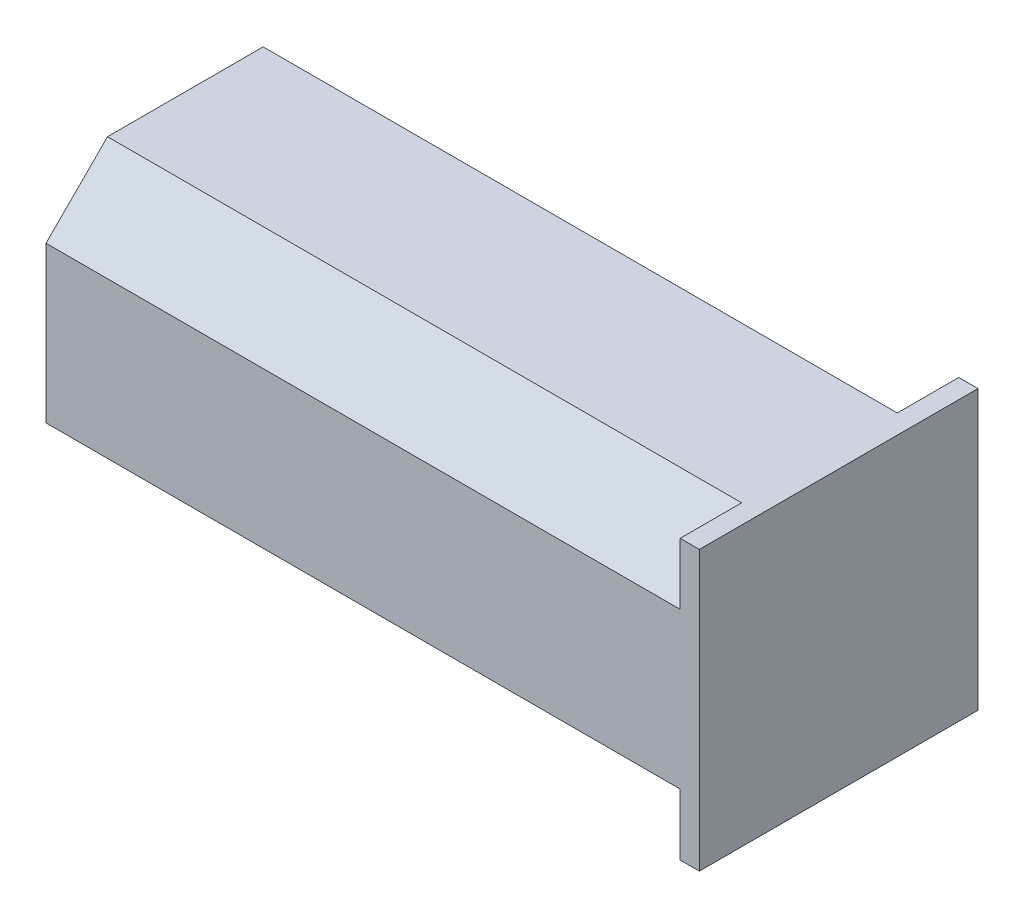
ISO-10303-21;
HEADER;
FILE_DESCRIPTION(('STEP AP214'),'2;1');
FILE_NAME('part.step','',(''),(''),'','','');
FILE_SCHEMA(('AUTOMOTIVE_DESIGN { 1 0 10303 214 1 1 1 1 }'));
ENDSEC;
DATA;
#1=APPLICATION_CONTEXT('core data for automotive mechanical design processes');
#2=APPLICATION_PROTOCOL_DEFINITION('international standard','automotive_design',2000,#1);
#3=PRODUCT_CONTEXT('',#1,'mechanical');
#4=PRODUCT('Part','Part','',(#3));
#5=PRODUCT_RELATED_PRODUCT_CATEGORY('part','',(#4));
#6=PRODUCT_DEFINITION_FORMATION('','',#4);
#7=PRODUCT_DEFINITION_CONTEXT('part definition',#1,'design');
#8=PRODUCT_DEFINITION('design','',#6,#7);
#9=PRODUCT_DEFINITION_SHAPE('','',#8);
#10=(LENGTH_UNIT() NAMED_UNIT(*) SI_UNIT(.MILLI.,.METRE.));
#11=(NAMED_UNIT(*) PLANE_ANGLE_UNIT() SI_UNIT($,.RADIAN.));
#12=(NAMED_UNIT(*) SI_UNIT($,.STERADIAN.) SOLID_ANGLE_UNIT());
#13=UNCERTAINTY_MEASURE_WITH_UNIT(LENGTH_MEASURE(1.E-05),#10,'distance_accuracy_value','');
#14=(GEOMETRIC_REPRESENTATION_CONTEXT(3) GLOBAL_UNCERTAINTY_ASSIGNED_CONTEXT((#13)) GLOBAL_UNIT_ASSIGNED_CONTEXT((#10,
#11,#12)) REPRESENTATION_CONTEXT('',''));
#15=CARTESIAN_POINT('',(0.,0.,0.));
#16=DIRECTION('',(0.,0.,1.));
#17=DIRECTION('',(1.,0.,0.));
#18=AXIS2_PLACEMENT_3D('',#15,#16,#17);
#19=CARTESIAN_POINT('',(122.000000000003,1.06322866211239E-13,1263.79860364586));
#20=DIRECTION('',(0.,0.,1.));
#21=DIRECTION('',(1.,0.,0.));
#22=AXIS2_PLACEMENT_3D('',#19,#20,#21);
#23=PLANE('',#22);
#24=DIRECTION('',(1.,0.,0.));
#25=VECTOR('',#24,1.);
#26=CARTESIAN_POINT('',(130.000000000003,-36.25,1263.79860364586));
#27=LINE('',#26,#25);
#28=CARTESIAN_POINT('',(122.000000000003,-36.25,1263.79860364586));
#29=VERTEX_POINT('',#28);
#30=CARTESIAN_POINT('',(127.000000000003,-36.25,1263.79860364586));
#31=VERTEX_POINT('',#30);
#32=EDGE_CURVE('E111',#29,#31,#27,.T.);
#33=ORIENTED_EDGE('',*,*,#32,.T.);
#34=DIRECTION('',(0.,1.,0.));
#35=VECTOR('',#34,1.);
#36=CARTESIAN_POINT('',(127.000000000003,1.06322866211239E-13,1263.79860364586));
#37=LINE('',#36,#35);
#38=CARTESIAN_POINT('',(127.000000000003,36.25,1263.79860364586));
#39=VERTEX_POINT('',#38);
#40=EDGE_CURVE('E102',#31,#39,#37,.T.);
#41=ORIENTED_EDGE('',*,*,#40,.T.);
#42=DIRECTION('',(1.,0.,0.));
#43=VECTOR('',#42,1.);
#44=CARTESIAN_POINT('',(130.000000000003,36.25,1263.79860364586));
#45=LINE('',#44,#43);
#46=CARTESIAN_POINT('',(122.000000000003,36.25,1263.79860364586));
#47=VERTEX_POINT('',#46);
#48=EDGE_CURVE('E20',#47,#39,#45,.T.);
#49=ORIENTED_EDGE('',*,*,#48,.F.);
#50=DIRECTION('',(0.,-1.,0.));
#51=VECTOR('',#50,1.);
#52=CARTESIAN_POINT('',(122.000000000003,36.25,1263.79860364586));
#53=LINE('',#52,#51);
#54=CARTESIAN_POINT('',(122.000000000003,20.25,1263.79860364586));
#55=VERTEX_POINT('',#54);
#56=EDGE_CURVE('E110',#47,#55,#53,.T.);
#57=ORIENTED_EDGE('',*,*,#56,.T.);
#58=DIRECTION('',(-1.,0.,0.));
#59=VECTOR('',#58,1.);
#60=CARTESIAN_POINT('',(122.000000000003,20.25,1263.79860364586));
#61=LINE('',#60,#59);
#62=CARTESIAN_POINT('',(-42.999999999997,20.25,1263.79860364586));
#63=VERTEX_POINT('',#62);
#64=EDGE_CURVE('E171',#55,#63,#61,.T.);
#65=ORIENTED_EDGE('',*,*,#64,.T.);
#66=DIRECTION('',(0.,-1.,0.));
#67=VECTOR('',#66,1.);
#68=CARTESIAN_POINT('',(-42.999999999997,1.26528871049308E-13,1263.79860364586));
#69=LINE('',#68,#67);
#70=CARTESIAN_POINT('',(-42.999999999997,-20.25,1263.79860364586));
#71=VERTEX_POINT('',#70);
#72=EDGE_CURVE('E168',#63,#71,#69,.T.);
#73=ORIENTED_EDGE('',*,*,#72,.T.);
#74=DIRECTION('',(1.,0.,0.));
#75=VECTOR('',#74,1.);
#76=CARTESIAN_POINT('',(122.000000000003,-20.25,1263.79860364586));
#77=LINE('',#76,#75);
#78=CARTESIAN_POINT('',(122.000000000003,-20.25,1263.79860364586));
#79=VERTEX_POINT('',#78);
#80=EDGE_CURVE('E170',#71,#79,#77,.T.);
#81=ORIENTED_EDGE('',*,*,#80,.T.);
#82=EDGE_CURVE('E115',#79,#29,#53,.T.);
#83=ORIENTED_EDGE('',*,*,#82,.T.);
#84=EDGE_LOOP('',(#33,#41,#49,#57,#65,#73,#81,#83));
#85=FACE_BOUND('',#84,.T.);
#86=ADVANCED_FACE('F16',(#85),#23,.T.);
#87=CARTESIAN_POINT('',(122.000000000003,-36.25,1227.54860364586));
#88=DIRECTION('',(0.,-1.,0.));
#89=DIRECTION('',(-1.,0.,0.));
#90=AXIS2_PLACEMENT_3D('',#87,#88,#89);
#91=PLANE('',#90);
#92=DIRECTION('',(1.,0.,0.));
#93=VECTOR('',#92,1.);
#94=CARTESIAN_POINT('',(130.000000000003,-36.25,1191.29860364586));
#95=LINE('',#94,#93);
#96=CARTESIAN_POINT('',(122.000000000003,-36.25,1191.29860364586));
#97=VERTEX_POINT('',#96);
#98=CARTESIAN_POINT('',(127.000000000003,-36.25,1191.29860364586));
#99=VERTEX_POINT('',#98);
#100=EDGE_CURVE('E122',#97,#99,#95,.T.);
#101=ORIENTED_EDGE('',*,*,#100,.T.);
#102=DIRECTION('',(0.,0.,1.));
#103=VECTOR('',#102,1.);
#104=CARTESIAN_POINT('',(127.000000000003,-36.25,1227.54860364586));
#105=LINE('',#104,#103);
#106=EDGE_CURVE('E105',#99,#31,#105,.T.);
#107=ORIENTED_EDGE('',*,*,#106,.T.);
#108=ORIENTED_EDGE('',*,*,#32,.F.);
#109=DIRECTION('',(0.,0.,1.));
#110=VECTOR('',#109,1.);
#111=CARTESIAN_POINT('',(122.000000000003,-36.25,1191.29860364586));
#112=LINE('',#111,#110);
#113=CARTESIAN_POINT('',(122.000000000003,-36.25,1247.79860364586));
#114=VERTEX_POINT('',#113);
#115=EDGE_CURVE('E198',#114,#29,#112,.T.);
#116=ORIENTED_EDGE('',*,*,#115,.F.);
#117=DIRECTION('',(-1.,0.,0.));
#118=VECTOR('',#117,1.);
#119=CARTESIAN_POINT('',(122.000000000003,-36.25,1247.79860364586));
#120=LINE('',#119,#118);
#121=CARTESIAN_POINT('',(-42.999999999997,-36.25,1247.79860364586));
#122=VERTEX_POINT('',#121);
#123=EDGE_CURVE('E123',#114,#122,#120,.T.);
#124=ORIENTED_EDGE('',*,*,#123,.T.);
#125=DIRECTION('',(0.,0.,-1.));
#126=VECTOR('',#125,1.);
#127=CARTESIAN_POINT('',(-42.999999999997,-36.25,1227.54860364586));
#128=LINE('',#127,#126);
#129=CARTESIAN_POINT('',(-42.999999999997,-36.25,1207.29860364586));
#130=VERTEX_POINT('',#129);
#131=EDGE_CURVE('E126',#122,#130,#128,.T.);
#132=ORIENTED_EDGE('',*,*,#131,.T.);
#133=DIRECTION('',(1.,0.,0.));
#134=VECTOR('',#133,1.);
#135=CARTESIAN_POINT('',(122.000000000003,-36.25,1207.29860364586));
#136=LINE('',#135,#134);
#137=CARTESIAN_POINT('',(122.000000000003,-36.25,1207.29860364586));
#138=VERTEX_POINT('',#137);
#139=EDGE_CURVE('E134',#130,#138,#136,.T.);
#140=ORIENTED_EDGE('',*,*,#139,.T.);
#141=EDGE_CURVE('E150',#97,#138,#112,.T.);
#142=ORIENTED_EDGE('',*,*,#141,.F.);
#143=EDGE_LOOP('',(#101,#107,#108,#116,#124,#132,#140,#142));
#144=FACE_BOUND('',#143,.T.);
#145=ADVANCED_FACE('F119',(#144),#91,.T.);
#146=CARTESIAN_POINT('',(122.000000000003,1.10762064243845E-13,1191.29860364586));
#147=DIRECTION('',(0.,0.,-1.));
#148=DIRECTION('',(-1.,0.,0.));
#149=AXIS2_PLACEMENT_3D('',#146,#147,#148);
#150=PLANE('',#149);
#151=DIRECTION('',(1.,0.,0.));
#152=VECTOR('',#151,1.);
#153=CARTESIAN_POINT('',(130.000000000003,36.25,1191.29860364586));
#154=LINE('',#153,#152);
#155=CARTESIAN_POINT('',(122.000000000003,36.25,1191.29860364586));
#156=VERTEX_POINT('',#155);
#157=CARTESIAN_POINT('',(127.000000000003,36.25,1191.29860364586));
#158=VERTEX_POINT('',#157);
#159=EDGE_CURVE('E133',#156,#158,#154,.T.);
#160=ORIENTED_EDGE('',*,*,#159,.T.);
#161=DIRECTION('',(0.,-1.,0.));
#162=VECTOR('',#161,1.);
#163=CARTESIAN_POINT('',(127.000000000003,1.10762064243845E-13,1191.29860364586));
#164=LINE('',#163,#162);
#165=EDGE_CURVE('E39',#158,#99,#164,.T.);
#166=ORIENTED_EDGE('',*,*,#165,.T.);
#167=ORIENTED_EDGE('',*,*,#100,.F.);
#168=DIRECTION('',(0.,-1.,0.));
#169=VECTOR('',#168,1.);
#170=CARTESIAN_POINT('',(122.000000000003,36.25,1191.29860364586));
#171=LINE('',#170,#169);
#172=CARTESIAN_POINT('',(122.000000000003,-20.25,1191.29860364586));
#173=VERTEX_POINT('',#172);
#174=EDGE_CURVE('E11',#173,#97,#171,.T.);
#175=ORIENTED_EDGE('',*,*,#174,.F.);
#176=DIRECTION('',(-1.,0.,0.));
#177=VECTOR('',#176,1.);
#178=CARTESIAN_POINT('',(122.000000000003,-20.25,1191.29860364586));
#179=LINE('',#178,#177);
#180=CARTESIAN_POINT('',(-42.999999999997,-20.25,1191.29860364586));
#181=VERTEX_POINT('',#180);
#182=EDGE_CURVE('E132',#173,#181,#179,.T.);
#183=ORIENTED_EDGE('',*,*,#182,.T.);
#184=DIRECTION('',(0.,1.,0.));
#185=VECTOR('',#184,1.);
#186=CARTESIAN_POINT('',(-42.999999999997,1.30968069081914E-13,1191.29860364586));
#187=LINE('',#186,#185);
#188=CARTESIAN_POINT('',(-42.999999999997,20.25,1191.29860364586));
#189=VERTEX_POINT('',#188);
#190=EDGE_CURVE('E173',#181,#189,#187,.T.);
#191=ORIENTED_EDGE('',*,*,#190,.T.);
#192=DIRECTION('',(1.,0.,0.));
#193=VECTOR('',#192,1.);
#194=CARTESIAN_POINT('',(122.000000000003,20.25,1191.29860364586));
#195=LINE('',#194,#193);
#196=CARTESIAN_POINT('',(122.000000000003,20.25,1191.29860364586));
#197=VERTEX_POINT('',#196);
#198=EDGE_CURVE('E176',#189,#197,#195,.T.);
#199=ORIENTED_EDGE('',*,*,#198,.T.);
#200=EDGE_CURVE('E164',#156,#197,#171,.T.);
#201=ORIENTED_EDGE('',*,*,#200,.F.);
#202=EDGE_LOOP('',(#160,#166,#167,#175,#183,#191,#199,#201));
#203=FACE_BOUND('',#202,.T.);
#204=ADVANCED_FACE('F250',(#203),#150,.T.);
#205=CARTESIAN_POINT('',(122.000000000003,36.25,1227.54860364586));
#206=DIRECTION('',(0.,1.,0.));
#207=DIRECTION('',(1.,0.,0.));
#208=AXIS2_PLACEMENT_3D('',#205,#206,#207);
#209=PLANE('',#208);
#210=ORIENTED_EDGE('',*,*,#48,.T.);
#211=DIRECTION('',(0.,0.,-1.));
#212=VECTOR('',#211,1.);
#213=CARTESIAN_POINT('',(127.000000000003,36.25,1227.54860364586));
#214=LINE('',#213,#212);
#215=EDGE_CURVE('E33',#39,#158,#214,.T.);
#216=ORIENTED_EDGE('',*,*,#215,.T.);
#217=ORIENTED_EDGE('',*,*,#159,.F.);
#218=DIRECTION('',(0.,0.,1.));
#219=VECTOR('',#218,1.);
#220=CARTESIAN_POINT('',(122.000000000003,36.25,1191.29860364586));
#221=LINE('',#220,#219);
#222=CARTESIAN_POINT('',(122.000000000003,36.25,1207.29860364586));
#223=VERTEX_POINT('',#222);
#224=EDGE_CURVE('E184',#156,#223,#221,.T.);
#225=ORIENTED_EDGE('',*,*,#224,.T.);
#226=DIRECTION('',(-1.,0.,0.));
#227=VECTOR('',#226,1.);
#228=CARTESIAN_POINT('',(122.000000000003,36.25,1207.29860364586));
#229=LINE('',#228,#227);
#230=CARTESIAN_POINT('',(-42.999999999997,36.25,1207.29860364586));
#231=VERTEX_POINT('',#230);
#232=EDGE_CURVE('E181',#223,#231,#229,.T.);
#233=ORIENTED_EDGE('',*,*,#232,.T.);
#234=DIRECTION('',(0.,0.,1.));
#235=VECTOR('',#234,1.);
#236=CARTESIAN_POINT('',(-42.999999999997,36.25,1227.54860364586));
#237=LINE('',#236,#235);
#238=CARTESIAN_POINT('',(-42.999999999997,36.25,1247.79860364586));
#239=VERTEX_POINT('',#238);
#240=EDGE_CURVE('E177',#231,#239,#237,.T.);
#241=ORIENTED_EDGE('',*,*,#240,.T.);
#242=DIRECTION('',(1.,0.,0.));
#243=VECTOR('',#242,1.);
#244=CARTESIAN_POINT('',(122.000000000003,36.25,1247.79860364586));
#245=LINE('',#244,#243);
#246=CARTESIAN_POINT('',(122.000000000003,36.25,1247.79860364586));
#247=VERTEX_POINT('',#246);
#248=EDGE_CURVE('E180',#239,#247,#245,.T.);
#249=ORIENTED_EDGE('',*,*,#248,.T.);
#250=EDGE_CURVE('E161',#247,#47,#221,.T.);
#251=ORIENTED_EDGE('',*,*,#250,.T.);
#252=EDGE_LOOP('',(#210,#216,#217,#225,#233,#241,#249,#251));
#253=FACE_BOUND('',#252,.T.);
#254=ADVANCED_FACE('F273',(#253),#209,.T.);
#255=CARTESIAN_POINT('',(-42.999999999997,1.28748470065611E-13,1227.54860364586));
#256=DIRECTION('',(-1.,0.,0.));
#257=DIRECTION('',(0.,1.,0.));
#258=AXIS2_PLACEMENT_3D('',#255,#256,#257);
#259=PLANE('',#258);
#260=ORIENTED_EDGE('',*,*,#240,.F.);
#261=DIRECTION('',(0.,0.707106781186547,0.707106781186548));
#262=VECTOR('',#261,1.);
#263=CARTESIAN_POINT('',(-42.999999999997,28.25,1199.29860364586));
#264=LINE('',#263,#262);
#265=EDGE_CURVE('E158',#231,#189,#264,.F.);
#266=ORIENTED_EDGE('',*,*,#265,.T.);
#267=ORIENTED_EDGE('',*,*,#190,.F.);
#268=DIRECTION('',(0.,0.707106781186547,-0.707106781186548));
#269=VECTOR('',#268,1.);
#270=CARTESIAN_POINT('',(-42.999999999997,-28.25,1199.29860364586));
#271=LINE('',#270,#269);
#272=EDGE_CURVE('E160',#181,#130,#271,.F.);
#273=ORIENTED_EDGE('',*,*,#272,.T.);
#274=ORIENTED_EDGE('',*,*,#131,.F.);
#275=DIRECTION('',(0.,-0.707106781186547,-0.707106781186548));
#276=VECTOR('',#275,1.);
#277=CARTESIAN_POINT('',(-42.999999999997,-28.25,1255.79860364586));
#278=LINE('',#277,#276);
#279=EDGE_CURVE('E165',#122,#71,#278,.F.);
#280=ORIENTED_EDGE('',*,*,#279,.T.);
#281=ORIENTED_EDGE('',*,*,#72,.F.);
#282=DIRECTION('',(0.,-0.707106781186547,0.707106781186548));
#283=VECTOR('',#282,1.);
#284=CARTESIAN_POINT('',(-42.999999999997,28.25,1255.79860364586));
#285=LINE('',#284,#283);
#286=EDGE_CURVE('E162',#63,#239,#285,.F.);
#287=ORIENTED_EDGE('',*,*,#286,.T.);
#288=EDGE_LOOP('',(#260,#266,#267,#273,#274,#280,#281,#287));
#289=FACE_BOUND('',#288,.T.);
#290=ADVANCED_FACE('F243',(#289),#259,.T.);
#291=CARTESIAN_POINT('',(122.000000000003,36.25,1207.29860364586));
#292=DIRECTION('',(0.,-0.707106781186548,0.707106781186547));
#293=DIRECTION('',(0.,-0.707106781186547,-0.707106781186548));
#294=AXIS2_PLACEMENT_3D('',#291,#292,#293);
#295=PLANE('',#294);
#296=DIRECTION('',(0.,-0.707106781186547,-0.707106781186548));
#297=VECTOR('',#296,1.);
#298=CARTESIAN_POINT('',(122.000000000003,28.25,1199.29860364586));
#299=LINE('',#298,#297);
#300=EDGE_CURVE('E216',#197,#223,#299,.F.);
#301=ORIENTED_EDGE('',*,*,#300,.F.);
#302=ORIENTED_EDGE('',*,*,#198,.F.);
#303=ORIENTED_EDGE('',*,*,#265,.F.);
#304=ORIENTED_EDGE('',*,*,#232,.F.);
#305=EDGE_LOOP('',(#301,#302,#303,#304));
#306=FACE_BOUND('',#305,.T.);
#307=ADVANCED_FACE('F278',(#306),#295,.F.);
#308=CARTESIAN_POINT('',(122.000000000003,20.25,1263.79860364586));
#309=DIRECTION('',(0.,-0.707106781186548,-0.707106781186547));
#310=DIRECTION('',(0.,0.707106781186547,-0.707106781186548));
#311=AXIS2_PLACEMENT_3D('',#308,#309,#310);
#312=PLANE('',#311);
#313=DIRECTION('',(0.,0.707106781186547,-0.707106781186548));
#314=VECTOR('',#313,1.);
#315=CARTESIAN_POINT('',(122.000000000003,28.25,1255.79860364586));
#316=LINE('',#315,#314);
#317=EDGE_CURVE('E220',#247,#55,#316,.F.);
#318=ORIENTED_EDGE('',*,*,#317,.F.);
#319=ORIENTED_EDGE('',*,*,#248,.F.);
#320=ORIENTED_EDGE('',*,*,#286,.F.);
#321=ORIENTED_EDGE('',*,*,#64,.F.);
#322=EDGE_LOOP('',(#318,#319,#320,#321));
#323=FACE_BOUND('',#322,.T.);
#324=ADVANCED_FACE('F283',(#323),#312,.F.);
#325=CARTESIAN_POINT('',(122.000000000003,-36.25,1247.79860364586));
#326=DIRECTION('',(0.,0.707106781186548,-0.707106781186547));
#327=DIRECTION('',(0.,0.707106781186547,0.707106781186548));
#328=AXIS2_PLACEMENT_3D('',#325,#326,#327);
#329=PLANE('',#328);
#330=DIRECTION('',(0.,0.707106781186547,0.707106781186548));
#331=VECTOR('',#330,1.);
#332=CARTESIAN_POINT('',(122.000000000003,-28.25,1255.79860364586));
#333=LINE('',#332,#331);
#334=EDGE_CURVE('E200',#79,#114,#333,.F.);
#335=ORIENTED_EDGE('',*,*,#334,.F.);
#336=ORIENTED_EDGE('',*,*,#80,.F.);
#337=ORIENTED_EDGE('',*,*,#279,.F.);
#338=ORIENTED_EDGE('',*,*,#123,.F.);
#339=EDGE_LOOP('',(#335,#336,#337,#338));
#340=FACE_BOUND('',#339,.T.);
#341=ADVANCED_FACE('F289',(#340),#329,.F.);
#342=CARTESIAN_POINT('',(122.000000000003,-20.25,1191.29860364586));
#343=DIRECTION('',(0.,0.707106781186548,0.707106781186547));
#344=DIRECTION('',(0.,-0.707106781186547,0.707106781186548));
#345=AXIS2_PLACEMENT_3D('',#342,#343,#344);
#346=PLANE('',#345);
#347=DIRECTION('',(0.,-0.707106781186547,0.707106781186548));
#348=VECTOR('',#347,1.);
#349=CARTESIAN_POINT('',(122.000000000003,-28.25,1199.29860364586));
#350=LINE('',#349,#348);
#351=EDGE_CURVE('E25',#138,#173,#350,.F.);
#352=ORIENTED_EDGE('',*,*,#351,.F.);
#353=ORIENTED_EDGE('',*,*,#139,.F.);
#354=ORIENTED_EDGE('',*,*,#272,.F.);
#355=ORIENTED_EDGE('',*,*,#182,.F.);
#356=EDGE_LOOP('',(#352,#353,#354,#355));
#357=FACE_BOUND('',#356,.T.);
#358=ADVANCED_FACE('F248',(#357),#346,.F.);
#359=CARTESIAN_POINT('',(122.000000000003,36.25,1263.79860364586));
#360=DIRECTION('',(-1.,0.,0.));
#361=DIRECTION('',(0.,-1.,0.));
#362=AXIS2_PLACEMENT_3D('',#359,#360,#361);
#363=PLANE('',#362);
#364=ORIENTED_EDGE('',*,*,#200,.T.);
#365=ORIENTED_EDGE('',*,*,#300,.T.);
#366=ORIENTED_EDGE('',*,*,#224,.F.);
#367=EDGE_LOOP('',(#364,#365,#366));
#368=FACE_BOUND('',#367,.T.);
#369=ADVANCED_FACE('F255',(#368),#363,.T.);
#370=ORIENTED_EDGE('',*,*,#250,.F.);
#371=ORIENTED_EDGE('',*,*,#317,.T.);
#372=ORIENTED_EDGE('',*,*,#56,.F.);
#373=EDGE_LOOP('',(#370,#371,#372));
#374=FACE_BOUND('',#373,.T.);
#375=ADVANCED_FACE('F261',(#374),#363,.T.);
#376=ORIENTED_EDGE('',*,*,#82,.F.);
#377=ORIENTED_EDGE('',*,*,#334,.T.);
#378=ORIENTED_EDGE('',*,*,#115,.T.);
#379=EDGE_LOOP('',(#376,#377,#378));
#380=FACE_BOUND('',#379,.T.);
#381=ADVANCED_FACE('F237',(#380),#363,.T.);
#382=ORIENTED_EDGE('',*,*,#141,.T.);
#383=ORIENTED_EDGE('',*,*,#351,.T.);
#384=ORIENTED_EDGE('',*,*,#174,.T.);
#385=EDGE_LOOP('',(#382,#383,#384));
#386=FACE_BOUND('',#385,.T.);
#387=ADVANCED_FACE('F252',(#386),#363,.T.);
#388=CARTESIAN_POINT('',(127.000000000003,0.,1227.54860364586));
#389=DIRECTION('',(1.,0.,0.));
#390=DIRECTION('',(0.,0.,-1.));
#391=AXIS2_PLACEMENT_3D('',#388,#389,#390);
#392=PLANE('',#391);
#393=ORIENTED_EDGE('',*,*,#40,.F.);
#394=ORIENTED_EDGE('',*,*,#106,.F.);
#395=ORIENTED_EDGE('',*,*,#165,.F.);
#396=ORIENTED_EDGE('',*,*,#215,.F.);
#397=EDGE_LOOP('',(#393,#394,#395,#396));
#398=FACE_BOUND('',#397,.T.);
#399=ADVANCED_FACE('F18',(#398),#392,.T.);
#400=CLOSED_SHELL('',(#86,#145,#204,#254,#290,#307,#324,#341,#358,#369,#375,#381,#387,#399));
#401=MANIFOLD_SOLID_BREP('B1',#400);
#402=ADVANCED_BREP_SHAPE_REPRESENTATION('',(#18,#401),#14);
#403=SHAPE_DEFINITION_REPRESENTATION(#9,#402);
ENDSEC;
END-ISO-10303-21;
